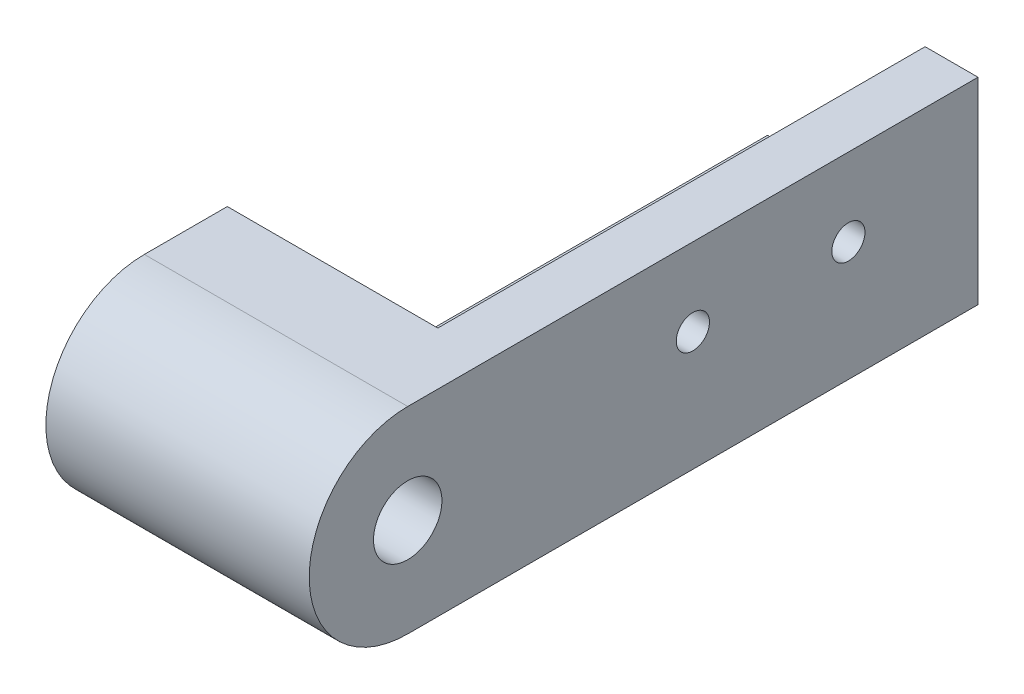
ISO-10303-21;
HEADER;
FILE_DESCRIPTION(('STEP AP214'),'2;1');
FILE_NAME('part.step','',(''),(''),'','','');
FILE_SCHEMA(('AUTOMOTIVE_DESIGN { 1 0 10303 214 1 1 1 1 }'));
ENDSEC;
DATA;
#1=APPLICATION_CONTEXT('core data for automotive mechanical design processes');
#2=APPLICATION_PROTOCOL_DEFINITION('international standard','automotive_design',2000,#1);
#3=PRODUCT_CONTEXT('',#1,'mechanical');
#4=PRODUCT('Part','Part','',(#3));
#5=PRODUCT_RELATED_PRODUCT_CATEGORY('part','',(#4));
#6=PRODUCT_DEFINITION_FORMATION('','',#4);
#7=PRODUCT_DEFINITION_CONTEXT('part definition',#1,'design');
#8=PRODUCT_DEFINITION('design','',#6,#7);
#9=PRODUCT_DEFINITION_SHAPE('','',#8);
#10=(LENGTH_UNIT() NAMED_UNIT(*) SI_UNIT(.MILLI.,.METRE.));
#11=(NAMED_UNIT(*) PLANE_ANGLE_UNIT() SI_UNIT($,.RADIAN.));
#12=(NAMED_UNIT(*) SI_UNIT($,.STERADIAN.) SOLID_ANGLE_UNIT());
#13=UNCERTAINTY_MEASURE_WITH_UNIT(LENGTH_MEASURE(1.E-05),#10,'distance_accuracy_value','');
#14=(GEOMETRIC_REPRESENTATION_CONTEXT(3) GLOBAL_UNCERTAINTY_ASSIGNED_CONTEXT((#13)) GLOBAL_UNIT_ASSIGNED_CONTEXT((#10,
#11,#12)) REPRESENTATION_CONTEXT('',''));
#15=CARTESIAN_POINT('',(0.,0.,0.));
#16=DIRECTION('',(0.,0.,1.));
#17=DIRECTION('',(1.,0.,0.));
#18=AXIS2_PLACEMENT_3D('',#15,#16,#17);
#19=CARTESIAN_POINT('',(15.2,0.,50.));
#20=DIRECTION('',(0.,-1.,0.));
#21=DIRECTION('',(0.,0.,-1.));
#22=AXIS2_PLACEMENT_3D('',#19,#20,#21);
#23=PLANE('',#22);
#24=CARTESIAN_POINT('',(7.6,0.,12.5));
#25=DIRECTION('',(0.,-1.,0.));
#26=DIRECTION('',(0.,0.,-1.));
#27=AXIS2_PLACEMENT_3D('',#24,#25,#26);
#28=CIRCLE('',#27,1.74685854861741);
#29=CARTESIAN_POINT('',(7.6,0.,10.7531414513826));
#30=VERTEX_POINT('',#29);
#31=EDGE_CURVE('E143',#30,#30,#28,.T.);
#32=ORIENTED_EDGE('',*,*,#31,.T.);
#33=EDGE_LOOP('',(#32));
#34=FACE_BOUND('',#33,.T.);
#35=CARTESIAN_POINT('',(7.6,0.,27.5));
#36=DIRECTION('',(0.,-1.,0.));
#37=DIRECTION('',(0.,0.,-1.));
#38=AXIS2_PLACEMENT_3D('',#35,#36,#37);
#39=CIRCLE('',#38,1.6);
#40=CARTESIAN_POINT('',(7.6,0.,25.9));
#41=VERTEX_POINT('',#40);
#42=EDGE_CURVE('E208',#41,#41,#39,.T.);
#43=ORIENTED_EDGE('',*,*,#42,.T.);
#44=EDGE_LOOP('',(#43));
#45=FACE_BOUND('',#44,.T.);
#46=DIRECTION('',(-1.,0.,0.));
#47=VECTOR('',#46,1.);
#48=CARTESIAN_POINT('',(15.2,0.,47.));
#49=LINE('',#48,#47);
#50=CARTESIAN_POINT('',(15.2,0.,47.));
#51=VERTEX_POINT('',#50);
#52=CARTESIAN_POINT('',(0.,0.,47.));
#53=VERTEX_POINT('',#52);
#54=EDGE_CURVE('E60',#51,#53,#49,.T.);
#55=ORIENTED_EDGE('',*,*,#54,.F.);
#56=DIRECTION('',(0.,0.,-1.));
#57=VECTOR('',#56,1.);
#58=CARTESIAN_POINT('',(15.2,0.,50.));
#59=LINE('',#58,#57);
#60=CARTESIAN_POINT('',(15.2,0.,0.));
#61=VERTEX_POINT('',#60);
#62=EDGE_CURVE('E179',#51,#61,#59,.T.);
#63=ORIENTED_EDGE('',*,*,#62,.T.);
#64=DIRECTION('',(-1.,0.,0.));
#65=VECTOR('',#64,1.);
#66=CARTESIAN_POINT('',(15.2,0.,0.));
#67=LINE('',#66,#65);
#68=CARTESIAN_POINT('',(0.,0.,0.));
#69=VERTEX_POINT('',#68);
#70=EDGE_CURVE('E163',#61,#69,#67,.T.);
#71=ORIENTED_EDGE('',*,*,#70,.T.);
#72=DIRECTION('',(0.,0.,1.));
#73=VECTOR('',#72,1.);
#74=CARTESIAN_POINT('',(0.,0.,50.));
#75=LINE('',#74,#73);
#76=EDGE_CURVE('E196',#69,#53,#75,.T.);
#77=ORIENTED_EDGE('',*,*,#76,.T.);
#78=EDGE_LOOP('',(#55,#63,#71,#77));
#79=FACE_BOUND('',#78,.T.);
#80=ADVANCED_FACE('F35',(#34,#45,#79),#23,.F.);
#81=CARTESIAN_POINT('',(15.2,15.,50.));
#82=DIRECTION('',(1.,0.,0.));
#83=DIRECTION('',(0.,1.,0.));
#84=AXIS2_PLACEMENT_3D('',#81,#82,#83);
#85=PLANE('',#84);
#86=CARTESIAN_POINT('',(15.2,7.5,12.5));
#87=DIRECTION('',(1.,0.,0.));
#88=DIRECTION('',(0.,1.,0.));
#89=AXIS2_PLACEMENT_3D('',#86,#87,#88);
#90=CIRCLE('',#89,1.6);
#91=CARTESIAN_POINT('',(15.2,9.1,12.5));
#92=VERTEX_POINT('',#91);
#93=EDGE_CURVE('E131',#92,#92,#90,.T.);
#94=ORIENTED_EDGE('',*,*,#93,.T.);
#95=EDGE_LOOP('',(#94));
#96=FACE_BOUND('',#95,.T.);
#97=CARTESIAN_POINT('',(15.2,7.50000000000001,27.5));
#98=DIRECTION('',(1.,0.,0.));
#99=DIRECTION('',(0.,1.,0.));
#100=AXIS2_PLACEMENT_3D('',#97,#98,#99);
#101=CIRCLE('',#100,1.60271377987717);
#102=CARTESIAN_POINT('',(15.2,9.10271377987717,27.5));
#103=VERTEX_POINT('',#102);
#104=EDGE_CURVE('E135',#103,#103,#101,.T.);
#105=ORIENTED_EDGE('',*,*,#104,.T.);
#106=EDGE_LOOP('',(#105));
#107=FACE_BOUND('',#106,.T.);
#108=DIRECTION('',(0.,-1.,0.));
#109=VECTOR('',#108,1.);
#110=CARTESIAN_POINT('',(15.2,30.4932243254915,47.));
#111=LINE('',#110,#109);
#112=CARTESIAN_POINT('',(15.2,15.,47.));
#113=VERTEX_POINT('',#112);
#114=EDGE_CURVE('E187',#113,#51,#111,.T.);
#115=ORIENTED_EDGE('',*,*,#114,.F.);
#116=DIRECTION('',(0.,0.,-1.));
#117=VECTOR('',#116,1.);
#118=CARTESIAN_POINT('',(15.2,15.,50.));
#119=LINE('',#118,#117);
#120=CARTESIAN_POINT('',(15.2,15.,0.));
#121=VERTEX_POINT('',#120);
#122=EDGE_CURVE('E38',#113,#121,#119,.T.);
#123=ORIENTED_EDGE('',*,*,#122,.T.);
#124=DIRECTION('',(0.,-1.,0.));
#125=VECTOR('',#124,1.);
#126=CARTESIAN_POINT('',(15.2,15.,0.));
#127=LINE('',#126,#125);
#128=EDGE_CURVE('E176',#121,#61,#127,.T.);
#129=ORIENTED_EDGE('',*,*,#128,.T.);
#130=ORIENTED_EDGE('',*,*,#62,.F.);
#131=EDGE_LOOP('',(#115,#123,#129,#130));
#132=FACE_BOUND('',#131,.T.);
#133=ADVANCED_FACE('F184',(#96,#107,#132),#85,.F.);
#134=CARTESIAN_POINT('',(20.3,15.,50.));
#135=DIRECTION('',(0.,-1.,0.));
#136=DIRECTION('',(0.,0.,-1.));
#137=AXIS2_PLACEMENT_3D('',#134,#135,#136);
#138=PLANE('',#137);
#139=ORIENTED_EDGE('',*,*,#122,.F.);
#140=DIRECTION('',(1.,0.,0.));
#141=VECTOR('',#140,1.);
#142=CARTESIAN_POINT('',(0.,15.,47.));
#143=LINE('',#142,#141);
#144=CARTESIAN_POINT('',(-5.1,15.,47.));
#145=VERTEX_POINT('',#144);
#146=EDGE_CURVE('E52',#145,#113,#143,.T.);
#147=ORIENTED_EDGE('',*,*,#146,.F.);
#148=DIRECTION('',(0.,0.,-1.));
#149=VECTOR('',#148,1.);
#150=CARTESIAN_POINT('',(-5.1,15.,50.));
#151=LINE('',#150,#149);
#152=CARTESIAN_POINT('',(-5.1,15.,55.));
#153=VERTEX_POINT('',#152);
#154=EDGE_CURVE('E11',#153,#145,#151,.T.);
#155=ORIENTED_EDGE('',*,*,#154,.F.);
#156=DIRECTION('',(1.,0.,0.));
#157=VECTOR('',#156,1.);
#158=CARTESIAN_POINT('',(-5.1,15.,55.));
#159=LINE('',#158,#157);
#160=CARTESIAN_POINT('',(20.3,15.,55.));
#161=VERTEX_POINT('',#160);
#162=EDGE_CURVE('E154',#153,#161,#159,.T.);
#163=ORIENTED_EDGE('',*,*,#162,.T.);
#164=DIRECTION('',(0.,0.,-1.));
#165=VECTOR('',#164,1.);
#166=CARTESIAN_POINT('',(20.3,15.,50.));
#167=LINE('',#166,#165);
#168=CARTESIAN_POINT('',(20.3,15.,0.));
#169=VERTEX_POINT('',#168);
#170=EDGE_CURVE('E126',#161,#169,#167,.T.);
#171=ORIENTED_EDGE('',*,*,#170,.T.);
#172=DIRECTION('',(-1.,0.,0.));
#173=VECTOR('',#172,1.);
#174=CARTESIAN_POINT('',(20.3,15.,0.));
#175=LINE('',#174,#173);
#176=EDGE_CURVE('E173',#169,#121,#175,.T.);
#177=ORIENTED_EDGE('',*,*,#176,.T.);
#178=EDGE_LOOP('',(#139,#147,#155,#163,#171,#177));
#179=FACE_BOUND('',#178,.T.);
#180=ADVANCED_FACE('F189',(#179),#138,.F.);
#181=CARTESIAN_POINT('',(-5.1,15.,50.));
#182=DIRECTION('',(1.,0.,0.));
#183=DIRECTION('',(0.,1.,0.));
#184=AXIS2_PLACEMENT_3D('',#181,#182,#183);
#185=PLANE('',#184);
#186=CARTESIAN_POINT('',(-5.1,5.5,55.));
#187=DIRECTION('',(1.,0.,0.));
#188=DIRECTION('',(0.,0.,-1.));
#189=AXIS2_PLACEMENT_3D('',#186,#187,#188);
#190=CIRCLE('',#189,3.3);
#191=CARTESIAN_POINT('',(-5.1,5.5,51.7));
#192=VERTEX_POINT('',#191);
#193=EDGE_CURVE('E160',#192,#192,#190,.T.);
#194=ORIENTED_EDGE('',*,*,#193,.T.);
#195=EDGE_LOOP('',(#194));
#196=FACE_BOUND('',#195,.T.);
#197=ORIENTED_EDGE('',*,*,#154,.T.);
#198=DIRECTION('',(0.,1.,0.));
#199=VECTOR('',#198,1.);
#200=CARTESIAN_POINT('',(-5.1,-4.,47.));
#201=LINE('',#200,#199);
#202=CARTESIAN_POINT('',(-5.1,-4.,47.));
#203=VERTEX_POINT('',#202);
#204=EDGE_CURVE('E105',#203,#145,#201,.T.);
#205=ORIENTED_EDGE('',*,*,#204,.F.);
#206=DIRECTION('',(0.,0.,-1.));
#207=VECTOR('',#206,1.);
#208=CARTESIAN_POINT('',(-5.1,-4.,50.));
#209=LINE('',#208,#207);
#210=CARTESIAN_POINT('',(-5.1,-4.,55.));
#211=VERTEX_POINT('',#210);
#212=EDGE_CURVE('E44',#211,#203,#209,.T.);
#213=ORIENTED_EDGE('',*,*,#212,.F.);
#214=CARTESIAN_POINT('',(-5.1,5.5,55.));
#215=DIRECTION('',(-1.,0.,0.));
#216=DIRECTION('',(0.,0.,-1.));
#217=AXIS2_PLACEMENT_3D('',#214,#215,#216);
#218=CIRCLE('',#217,9.5);
#219=EDGE_CURVE('E152',#211,#153,#218,.T.);
#220=ORIENTED_EDGE('',*,*,#219,.T.);
#221=EDGE_LOOP('',(#197,#205,#213,#220));
#222=FACE_BOUND('',#221,.T.);
#223=ADVANCED_FACE('F115',(#196,#222),#185,.F.);
#224=CARTESIAN_POINT('',(-5.1,-4.,50.));
#225=DIRECTION('',(0.,1.,0.));
#226=DIRECTION('',(-1.,0.,0.));
#227=AXIS2_PLACEMENT_3D('',#224,#225,#226);
#228=PLANE('',#227);
#229=CARTESIAN_POINT('',(7.6,-4.,27.5));
#230=DIRECTION('',(0.,-1.,0.));
#231=DIRECTION('',(1.,0.,0.));
#232=AXIS2_PLACEMENT_3D('',#229,#230,#231);
#233=CIRCLE('',#232,1.6);
#234=CARTESIAN_POINT('',(9.2,-4.,27.5));
#235=VERTEX_POINT('',#234);
#236=EDGE_CURVE('E205',#235,#235,#233,.T.);
#237=ORIENTED_EDGE('',*,*,#236,.F.);
#238=EDGE_LOOP('',(#237));
#239=FACE_BOUND('',#238,.T.);
#240=CARTESIAN_POINT('',(7.6,-4.,12.5));
#241=DIRECTION('',(0.,-1.,0.));
#242=DIRECTION('',(1.,0.,0.));
#243=AXIS2_PLACEMENT_3D('',#240,#241,#242);
#244=CIRCLE('',#243,1.74685854861741);
#245=CARTESIAN_POINT('',(9.3468585486174,-4.,12.5));
#246=VERTEX_POINT('',#245);
#247=EDGE_CURVE('E148',#246,#246,#244,.T.);
#248=ORIENTED_EDGE('',*,*,#247,.F.);
#249=EDGE_LOOP('',(#248));
#250=FACE_BOUND('',#249,.T.);
#251=DIRECTION('',(1.,0.,0.));
#252=VECTOR('',#251,1.);
#253=CARTESIAN_POINT('',(0.,-4.,47.));
#254=LINE('',#253,#252);
#255=CARTESIAN_POINT('',(0.,-4.,47.));
#256=VERTEX_POINT('',#255);
#257=EDGE_CURVE('E102',#203,#256,#254,.T.);
#258=ORIENTED_EDGE('',*,*,#257,.T.);
#259=DIRECTION('',(0.,0.,-1.));
#260=VECTOR('',#259,1.);
#261=CARTESIAN_POINT('',(0.,-4.,0.));
#262=LINE('',#261,#260);
#263=CARTESIAN_POINT('',(0.,-4.,0.));
#264=VERTEX_POINT('',#263);
#265=EDGE_CURVE('E111',#256,#264,#262,.T.);
#266=ORIENTED_EDGE('',*,*,#265,.T.);
#267=DIRECTION('',(1.,0.,0.));
#268=VECTOR('',#267,1.);
#269=CARTESIAN_POINT('',(-5.1,-4.,0.));
#270=LINE('',#269,#268);
#271=CARTESIAN_POINT('',(20.3,-4.,0.));
#272=VERTEX_POINT('',#271);
#273=EDGE_CURVE('E168',#264,#272,#270,.T.);
#274=ORIENTED_EDGE('',*,*,#273,.T.);
#275=DIRECTION('',(0.,0.,-1.));
#276=VECTOR('',#275,1.);
#277=CARTESIAN_POINT('',(20.3,-4.,50.));
#278=LINE('',#277,#276);
#279=CARTESIAN_POINT('',(20.3,-4.,55.));
#280=VERTEX_POINT('',#279);
#281=EDGE_CURVE('E123',#280,#272,#278,.T.);
#282=ORIENTED_EDGE('',*,*,#281,.F.);
#283=DIRECTION('',(1.,0.,0.));
#284=VECTOR('',#283,1.);
#285=CARTESIAN_POINT('',(-5.1,-4.,55.));
#286=LINE('',#285,#284);
#287=EDGE_CURVE('E122',#211,#280,#286,.T.);
#288=ORIENTED_EDGE('',*,*,#287,.F.);
#289=ORIENTED_EDGE('',*,*,#212,.T.);
#290=EDGE_LOOP('',(#258,#266,#274,#282,#288,#289));
#291=FACE_BOUND('',#290,.T.);
#292=ADVANCED_FACE('F120',(#239,#250,#291),#228,.F.);
#293=CARTESIAN_POINT('',(20.3,-4.,50.));
#294=DIRECTION('',(-1.,0.,0.));
#295=DIRECTION('',(0.,0.,1.));
#296=AXIS2_PLACEMENT_3D('',#293,#294,#295);
#297=PLANE('',#296);
#298=CARTESIAN_POINT('',(20.3,7.50000000000001,27.5));
#299=DIRECTION('',(1.,0.,0.));
#300=DIRECTION('',(0.,0.,-1.));
#301=AXIS2_PLACEMENT_3D('',#298,#299,#300);
#302=CIRCLE('',#301,1.60271377987717);
#303=CARTESIAN_POINT('',(20.3,7.50000000000001,25.8972862201228));
#304=VERTEX_POINT('',#303);
#305=EDGE_CURVE('E137',#304,#304,#302,.T.);
#306=ORIENTED_EDGE('',*,*,#305,.F.);
#307=EDGE_LOOP('',(#306));
#308=FACE_BOUND('',#307,.T.);
#309=CARTESIAN_POINT('',(20.3,7.5,12.5));
#310=DIRECTION('',(1.,0.,0.));
#311=DIRECTION('',(0.,0.,-1.));
#312=AXIS2_PLACEMENT_3D('',#309,#310,#311);
#313=CIRCLE('',#312,1.6);
#314=CARTESIAN_POINT('',(20.3,7.5,10.9));
#315=VERTEX_POINT('',#314);
#316=EDGE_CURVE('E134',#315,#315,#313,.T.);
#317=ORIENTED_EDGE('',*,*,#316,.F.);
#318=EDGE_LOOP('',(#317));
#319=FACE_BOUND('',#318,.T.);
#320=CARTESIAN_POINT('',(20.3,5.5,55.));
#321=DIRECTION('',(1.,0.,0.));
#322=DIRECTION('',(0.,0.,-1.));
#323=AXIS2_PLACEMENT_3D('',#320,#321,#322);
#324=CIRCLE('',#323,3.3);
#325=CARTESIAN_POINT('',(20.3,5.5,51.7));
#326=VERTEX_POINT('',#325);
#327=EDGE_CURVE('E157',#326,#326,#324,.T.);
#328=ORIENTED_EDGE('',*,*,#327,.F.);
#329=EDGE_LOOP('',(#328));
#330=FACE_BOUND('',#329,.T.);
#331=ORIENTED_EDGE('',*,*,#170,.F.);
#332=CARTESIAN_POINT('',(20.3,5.5,55.));
#333=DIRECTION('',(-1.,0.,0.));
#334=DIRECTION('',(0.,0.,-1.));
#335=AXIS2_PLACEMENT_3D('',#332,#333,#334);
#336=CIRCLE('',#335,9.5);
#337=EDGE_CURVE('E133',#280,#161,#336,.T.);
#338=ORIENTED_EDGE('',*,*,#337,.F.);
#339=ORIENTED_EDGE('',*,*,#281,.T.);
#340=DIRECTION('',(0.,1.,0.));
#341=VECTOR('',#340,1.);
#342=CARTESIAN_POINT('',(20.3,-4.,0.));
#343=LINE('',#342,#341);
#344=EDGE_CURVE('E170',#272,#169,#343,.T.);
#345=ORIENTED_EDGE('',*,*,#344,.T.);
#346=EDGE_LOOP('',(#331,#338,#339,#345));
#347=FACE_BOUND('',#346,.T.);
#348=ADVANCED_FACE('F217',(#308,#319,#330,#347),#297,.F.);
#349=CARTESIAN_POINT('',(0.,0.,0.));
#350=DIRECTION('',(0.,0.,-1.));
#351=DIRECTION('',(-1.,0.,0.));
#352=AXIS2_PLACEMENT_3D('',#349,#350,#351);
#353=PLANE('',#352);
#354=DIRECTION('',(0.,1.,0.));
#355=VECTOR('',#354,1.);
#356=CARTESIAN_POINT('',(0.,-4.,0.));
#357=LINE('',#356,#355);
#358=EDGE_CURVE('E195',#264,#69,#357,.T.);
#359=ORIENTED_EDGE('',*,*,#358,.T.);
#360=ORIENTED_EDGE('',*,*,#70,.F.);
#361=ORIENTED_EDGE('',*,*,#128,.F.);
#362=ORIENTED_EDGE('',*,*,#176,.F.);
#363=ORIENTED_EDGE('',*,*,#344,.F.);
#364=ORIENTED_EDGE('',*,*,#273,.F.);
#365=EDGE_LOOP('',(#359,#360,#361,#362,#363,#364));
#366=FACE_BOUND('',#365,.T.);
#367=ADVANCED_FACE('F193',(#366),#353,.T.);
#368=CARTESIAN_POINT('',(-5.1,5.5,55.));
#369=DIRECTION('',(1.,0.,0.));
#370=DIRECTION('',(0.,0.,-1.));
#371=AXIS2_PLACEMENT_3D('',#368,#369,#370);
#372=CYLINDRICAL_SURFACE('',#371,3.3);
#373=ORIENTED_EDGE('',*,*,#193,.F.);
#374=EDGE_LOOP('',(#373));
#375=FACE_BOUND('',#374,.T.);
#376=ORIENTED_EDGE('',*,*,#327,.T.);
#377=EDGE_LOOP('',(#376));
#378=FACE_BOUND('',#377,.T.);
#379=ADVANCED_FACE('F263',(#375,#378),#372,.F.);
#380=CARTESIAN_POINT('',(-5.1,5.5,55.));
#381=DIRECTION('',(1.,0.,0.));
#382=DIRECTION('',(0.,0.,-1.));
#383=AXIS2_PLACEMENT_3D('',#380,#381,#382);
#384=CYLINDRICAL_SURFACE('',#383,9.5);
#385=ORIENTED_EDGE('',*,*,#337,.T.);
#386=ORIENTED_EDGE('',*,*,#162,.F.);
#387=ORIENTED_EDGE('',*,*,#219,.F.);
#388=ORIENTED_EDGE('',*,*,#287,.T.);
#389=EDGE_LOOP('',(#385,#386,#387,#388));
#390=FACE_BOUND('',#389,.T.);
#391=ADVANCED_FACE('F259',(#390),#384,.T.);
#392=CARTESIAN_POINT('',(-5.1,7.5,12.5));
#393=DIRECTION('',(1.,0.,0.));
#394=DIRECTION('',(0.,0.,-1.));
#395=AXIS2_PLACEMENT_3D('',#392,#393,#394);
#396=CYLINDRICAL_SURFACE('',#395,1.6);
#397=ORIENTED_EDGE('',*,*,#316,.T.);
#398=EDGE_LOOP('',(#397));
#399=FACE_BOUND('',#398,.T.);
#400=ORIENTED_EDGE('',*,*,#93,.F.);
#401=EDGE_LOOP('',(#400));
#402=FACE_BOUND('',#401,.T.);
#403=ADVANCED_FACE('F256',(#399,#402),#396,.F.);
#404=CARTESIAN_POINT('',(-5.1,7.50000000000001,27.5));
#405=DIRECTION('',(1.,0.,0.));
#406=DIRECTION('',(0.,0.,-1.));
#407=AXIS2_PLACEMENT_3D('',#404,#405,#406);
#408=CYLINDRICAL_SURFACE('',#407,1.60271377987717);
#409=ORIENTED_EDGE('',*,*,#305,.T.);
#410=EDGE_LOOP('',(#409));
#411=FACE_BOUND('',#410,.T.);
#412=ORIENTED_EDGE('',*,*,#104,.F.);
#413=EDGE_LOOP('',(#412));
#414=FACE_BOUND('',#413,.T.);
#415=ADVANCED_FACE('F250',(#411,#414),#408,.F.);
#416=CARTESIAN_POINT('',(7.6,15.00005,12.5));
#417=DIRECTION('',(0.,-1.,0.));
#418=DIRECTION('',(1.,0.,0.));
#419=AXIS2_PLACEMENT_3D('',#416,#417,#418);
#420=CYLINDRICAL_SURFACE('',#419,1.74685854861741);
#421=ORIENTED_EDGE('',*,*,#247,.T.);
#422=EDGE_LOOP('',(#421));
#423=FACE_BOUND('',#422,.T.);
#424=ORIENTED_EDGE('',*,*,#31,.F.);
#425=EDGE_LOOP('',(#424));
#426=FACE_BOUND('',#425,.T.);
#427=ADVANCED_FACE('F213',(#423,#426),#420,.F.);
#428=CARTESIAN_POINT('',(7.6,15.00005,27.5));
#429=DIRECTION('',(0.,-1.,0.));
#430=DIRECTION('',(1.,0.,0.));
#431=AXIS2_PLACEMENT_3D('',#428,#429,#430);
#432=CYLINDRICAL_SURFACE('',#431,1.6);
#433=ORIENTED_EDGE('',*,*,#236,.T.);
#434=EDGE_LOOP('',(#433));
#435=FACE_BOUND('',#434,.T.);
#436=ORIENTED_EDGE('',*,*,#42,.F.);
#437=EDGE_LOOP('',(#436));
#438=FACE_BOUND('',#437,.T.);
#439=ADVANCED_FACE('F239',(#435,#438),#432,.F.);
#440=CARTESIAN_POINT('',(0.,-4.,0.));
#441=DIRECTION('',(1.,0.,0.));
#442=DIRECTION('',(0.,0.,-1.));
#443=AXIS2_PLACEMENT_3D('',#440,#441,#442);
#444=PLANE('',#443);
#445=ORIENTED_EDGE('',*,*,#358,.F.);
#446=ORIENTED_EDGE('',*,*,#265,.F.);
#447=DIRECTION('',(0.,1.,0.));
#448=VECTOR('',#447,1.);
#449=CARTESIAN_POINT('',(0.,-4.,47.));
#450=LINE('',#449,#448);
#451=EDGE_CURVE('E106',#256,#53,#450,.T.);
#452=ORIENTED_EDGE('',*,*,#451,.T.);
#453=ORIENTED_EDGE('',*,*,#76,.F.);
#454=EDGE_LOOP('',(#445,#446,#452,#453));
#455=FACE_BOUND('',#454,.T.);
#456=ADVANCED_FACE('F241',(#455),#444,.F.);
#457=CARTESIAN_POINT('',(0.,-4.,47.));
#458=DIRECTION('',(0.,0.,1.));
#459=DIRECTION('',(1.,0.,0.));
#460=AXIS2_PLACEMENT_3D('',#457,#458,#459);
#461=PLANE('',#460);
#462=ORIENTED_EDGE('',*,*,#146,.T.);
#463=ORIENTED_EDGE('',*,*,#114,.T.);
#464=ORIENTED_EDGE('',*,*,#54,.T.);
#465=ORIENTED_EDGE('',*,*,#451,.F.);
#466=ORIENTED_EDGE('',*,*,#257,.F.);
#467=ORIENTED_EDGE('',*,*,#204,.T.);
#468=EDGE_LOOP('',(#462,#463,#464,#465,#466,#467));
#469=FACE_BOUND('',#468,.T.);
#470=ADVANCED_FACE('F104',(#469),#461,.F.);
#471=CLOSED_SHELL('',(#80,#133,#180,#223,#292,#348,#367,#379,#391,#403,#415,#427,#439,#456,#470));
#472=MANIFOLD_SOLID_BREP('B2',#471);
#473=ADVANCED_BREP_SHAPE_REPRESENTATION('',(#18,#472),#14);
#474=SHAPE_DEFINITION_REPRESENTATION(#9,#473);
ENDSEC;
END-ISO-10303-21;
